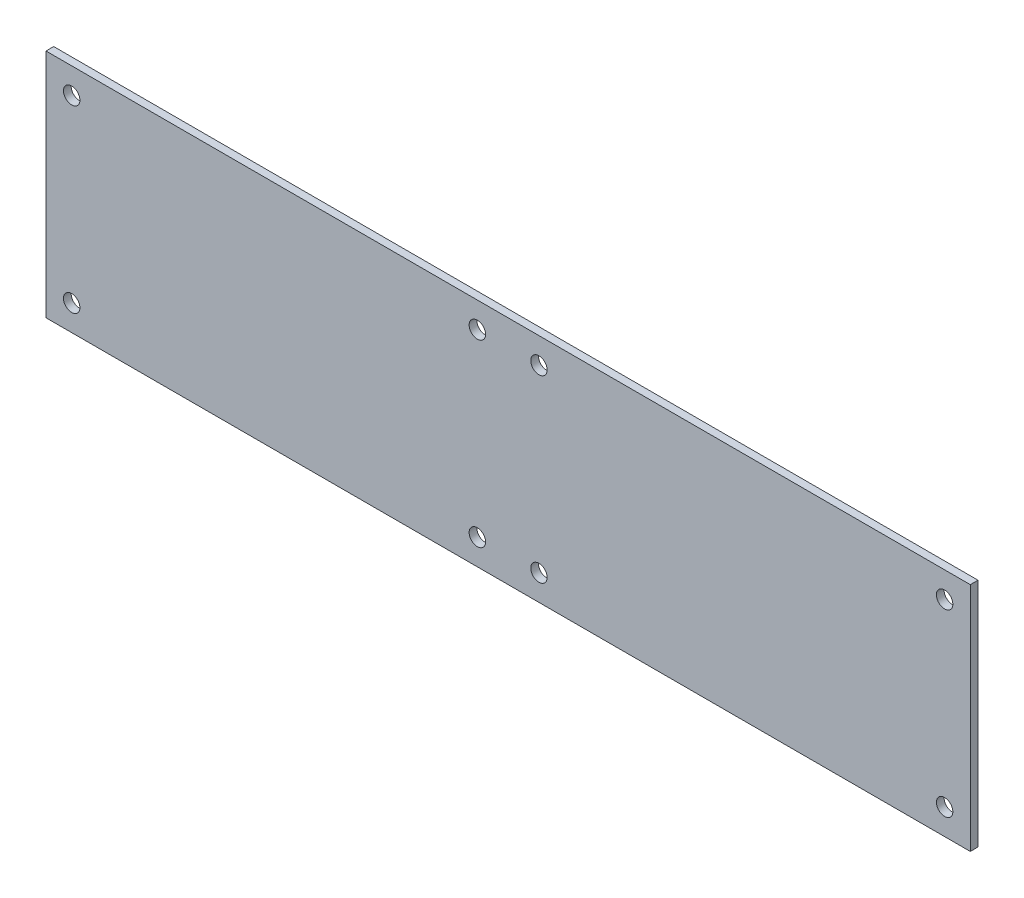
ISO-10303-21;
HEADER;
FILE_DESCRIPTION(('STEP AP214'),'2;1');
FILE_NAME('part.step','',(''),(''),'','','');
FILE_SCHEMA(('AUTOMOTIVE_DESIGN { 1 0 10303 214 1 1 1 1 }'));
ENDSEC;
DATA;
#1=APPLICATION_CONTEXT('core data for automotive mechanical design processes');
#2=APPLICATION_PROTOCOL_DEFINITION('international standard','automotive_design',2000,#1);
#3=PRODUCT_CONTEXT('',#1,'mechanical');
#4=PRODUCT('Part','Part','',(#3));
#5=PRODUCT_RELATED_PRODUCT_CATEGORY('part','',(#4));
#6=PRODUCT_DEFINITION_FORMATION('','',#4);
#7=PRODUCT_DEFINITION_CONTEXT('part definition',#1,'design');
#8=PRODUCT_DEFINITION('design','',#6,#7);
#9=PRODUCT_DEFINITION_SHAPE('','',#8);
#10=(LENGTH_UNIT() NAMED_UNIT(*) SI_UNIT(.MILLI.,.METRE.));
#11=(NAMED_UNIT(*) PLANE_ANGLE_UNIT() SI_UNIT($,.RADIAN.));
#12=(NAMED_UNIT(*) SI_UNIT($,.STERADIAN.) SOLID_ANGLE_UNIT());
#13=UNCERTAINTY_MEASURE_WITH_UNIT(LENGTH_MEASURE(1.E-05),#10,'distance_accuracy_value','');
#14=(GEOMETRIC_REPRESENTATION_CONTEXT(3) GLOBAL_UNCERTAINTY_ASSIGNED_CONTEXT((#13)) GLOBAL_UNIT_ASSIGNED_CONTEXT((#10,
#11,#12)) REPRESENTATION_CONTEXT('',''));
#15=CARTESIAN_POINT('',(0.,0.,0.));
#16=DIRECTION('',(0.,0.,1.));
#17=DIRECTION('',(1.,0.,0.));
#18=AXIS2_PLACEMENT_3D('',#15,#16,#17);
#19=CARTESIAN_POINT('',(0.,0.,1.5));
#20=DIRECTION('',(0.,0.,1.));
#21=DIRECTION('',(1.,0.,0.));
#22=AXIS2_PLACEMENT_3D('',#19,#20,#21);
#23=PLANE('',#22);
#24=CARTESIAN_POINT('',(-5.99999999999999,17.5,1.5));
#25=DIRECTION('',(0.,0.,1.));
#26=DIRECTION('',(1.,0.,0.));
#27=AXIS2_PLACEMENT_3D('',#24,#25,#26);
#28=CIRCLE('',#27,1.6);
#29=CARTESIAN_POINT('',(-4.39999999999999,17.5,1.5));
#30=VERTEX_POINT('',#29);
#31=EDGE_CURVE('E144',#30,#30,#28,.T.);
#32=ORIENTED_EDGE('',*,*,#31,.F.);
#33=EDGE_LOOP('',(#32));
#34=FACE_BOUND('',#33,.T.);
#35=CARTESIAN_POINT('',(-5.99999999999999,-17.5,1.5));
#36=DIRECTION('',(0.,0.,1.));
#37=DIRECTION('',(1.,0.,0.));
#38=AXIS2_PLACEMENT_3D('',#35,#36,#37);
#39=CIRCLE('',#38,1.6);
#40=CARTESIAN_POINT('',(-4.39999999999999,-17.5,1.5));
#41=VERTEX_POINT('',#40);
#42=EDGE_CURVE('E132',#41,#41,#39,.T.);
#43=ORIENTED_EDGE('',*,*,#42,.F.);
#44=EDGE_LOOP('',(#43));
#45=FACE_BOUND('',#44,.T.);
#46=CARTESIAN_POINT('',(85.,-17.5,1.5));
#47=DIRECTION('',(0.,0.,1.));
#48=DIRECTION('',(1.,0.,0.));
#49=AXIS2_PLACEMENT_3D('',#46,#47,#48);
#50=CIRCLE('',#49,1.6);
#51=CARTESIAN_POINT('',(86.6,-17.5,1.5));
#52=VERTEX_POINT('',#51);
#53=EDGE_CURVE('E120',#52,#52,#50,.T.);
#54=ORIENTED_EDGE('',*,*,#53,.F.);
#55=EDGE_LOOP('',(#54));
#56=FACE_BOUND('',#55,.T.);
#57=CARTESIAN_POINT('',(-85.,17.5,1.5));
#58=DIRECTION('',(0.,0.,1.));
#59=DIRECTION('',(1.,0.,0.));
#60=AXIS2_PLACEMENT_3D('',#57,#58,#59);
#61=CIRCLE('',#60,1.6);
#62=CARTESIAN_POINT('',(-83.4,17.5,1.5));
#63=VERTEX_POINT('',#62);
#64=EDGE_CURVE('E99',#63,#63,#61,.T.);
#65=ORIENTED_EDGE('',*,*,#64,.F.);
#66=EDGE_LOOP('',(#65));
#67=FACE_BOUND('',#66,.T.);
#68=DIRECTION('',(0.,-1.,0.));
#69=VECTOR('',#68,1.);
#70=CARTESIAN_POINT('',(-90.,22.5,1.5));
#71=LINE('',#70,#69);
#72=CARTESIAN_POINT('',(-90.,22.5,1.5));
#73=VERTEX_POINT('',#72);
#74=CARTESIAN_POINT('',(-90.,-22.5,1.5));
#75=VERTEX_POINT('',#74);
#76=EDGE_CURVE('E84',#73,#75,#71,.T.);
#77=ORIENTED_EDGE('',*,*,#76,.T.);
#78=DIRECTION('',(1.,0.,0.));
#79=VECTOR('',#78,1.);
#80=CARTESIAN_POINT('',(-90.,-22.5,1.5));
#81=LINE('',#80,#79);
#82=CARTESIAN_POINT('',(90.,-22.5,1.5));
#83=VERTEX_POINT('',#82);
#84=EDGE_CURVE('E79',#75,#83,#81,.T.);
#85=ORIENTED_EDGE('',*,*,#84,.T.);
#86=DIRECTION('',(0.,1.,0.));
#87=VECTOR('',#86,1.);
#88=CARTESIAN_POINT('',(90.,22.5,1.5));
#89=LINE('',#88,#87);
#90=CARTESIAN_POINT('',(90.,22.5,1.5));
#91=VERTEX_POINT('',#90);
#92=EDGE_CURVE('E82',#83,#91,#89,.T.);
#93=ORIENTED_EDGE('',*,*,#92,.T.);
#94=DIRECTION('',(-1.,0.,0.));
#95=VECTOR('',#94,1.);
#96=CARTESIAN_POINT('',(-90.,22.5,1.5));
#97=LINE('',#96,#95);
#98=EDGE_CURVE('E49',#91,#73,#97,.T.);
#99=ORIENTED_EDGE('',*,*,#98,.T.);
#100=EDGE_LOOP('',(#77,#85,#93,#99));
#101=FACE_BOUND('',#100,.T.);
#102=CARTESIAN_POINT('',(-85.,-17.5,1.5));
#103=DIRECTION('',(0.,0.,1.));
#104=DIRECTION('',(1.,0.,0.));
#105=AXIS2_PLACEMENT_3D('',#102,#103,#104);
#106=CIRCLE('',#105,1.6);
#107=CARTESIAN_POINT('',(-83.4,-17.5,1.5));
#108=VERTEX_POINT('',#107);
#109=EDGE_CURVE('E114',#108,#108,#106,.T.);
#110=ORIENTED_EDGE('',*,*,#109,.F.);
#111=EDGE_LOOP('',(#110));
#112=FACE_BOUND('',#111,.T.);
#113=CARTESIAN_POINT('',(85.,17.5,1.5));
#114=DIRECTION('',(0.,0.,1.));
#115=DIRECTION('',(1.,0.,0.));
#116=AXIS2_PLACEMENT_3D('',#113,#114,#115);
#117=CIRCLE('',#116,1.6);
#118=CARTESIAN_POINT('',(86.6,17.5,1.5));
#119=VERTEX_POINT('',#118);
#120=EDGE_CURVE('E126',#119,#119,#117,.T.);
#121=ORIENTED_EDGE('',*,*,#120,.F.);
#122=EDGE_LOOP('',(#121));
#123=FACE_BOUND('',#122,.T.);
#124=CARTESIAN_POINT('',(5.99999999999999,-17.5,1.5));
#125=DIRECTION('',(0.,0.,1.));
#126=DIRECTION('',(1.,0.,0.));
#127=AXIS2_PLACEMENT_3D('',#124,#125,#126);
#128=CIRCLE('',#127,1.6);
#129=CARTESIAN_POINT('',(7.59999999999999,-17.5,1.5));
#130=VERTEX_POINT('',#129);
#131=EDGE_CURVE('E138',#130,#130,#128,.T.);
#132=ORIENTED_EDGE('',*,*,#131,.F.);
#133=EDGE_LOOP('',(#132));
#134=FACE_BOUND('',#133,.T.);
#135=CARTESIAN_POINT('',(5.99999999999999,17.5,1.5));
#136=DIRECTION('',(0.,0.,1.));
#137=DIRECTION('',(1.,0.,0.));
#138=AXIS2_PLACEMENT_3D('',#135,#136,#137);
#139=CIRCLE('',#138,1.6);
#140=CARTESIAN_POINT('',(7.59999999999999,17.5,1.5));
#141=VERTEX_POINT('',#140);
#142=EDGE_CURVE('E150',#141,#141,#139,.T.);
#143=ORIENTED_EDGE('',*,*,#142,.F.);
#144=EDGE_LOOP('',(#143));
#145=FACE_BOUND('',#144,.T.);
#146=ADVANCED_FACE('F32',(#34,#45,#56,#67,#101,#112,#123,#134,#145),#23,.T.);
#147=CARTESIAN_POINT('',(0.,0.,0.));
#148=DIRECTION('',(0.,0.,1.));
#149=DIRECTION('',(1.,0.,0.));
#150=AXIS2_PLACEMENT_3D('',#147,#148,#149);
#151=PLANE('',#150);
#152=DIRECTION('',(0.,-1.,0.));
#153=VECTOR('',#152,1.);
#154=CARTESIAN_POINT('',(-90.,22.5,0.));
#155=LINE('',#154,#153);
#156=CARTESIAN_POINT('',(-90.,22.5,0.));
#157=VERTEX_POINT('',#156);
#158=CARTESIAN_POINT('',(-90.,-22.5,0.));
#159=VERTEX_POINT('',#158);
#160=EDGE_CURVE('E96',#157,#159,#155,.T.);
#161=ORIENTED_EDGE('',*,*,#160,.F.);
#162=DIRECTION('',(-1.,0.,0.));
#163=VECTOR('',#162,1.);
#164=CARTESIAN_POINT('',(-90.,22.5,0.));
#165=LINE('',#164,#163);
#166=CARTESIAN_POINT('',(90.,22.5,0.));
#167=VERTEX_POINT('',#166);
#168=EDGE_CURVE('E72',#167,#157,#165,.T.);
#169=ORIENTED_EDGE('',*,*,#168,.F.);
#170=DIRECTION('',(0.,1.,0.));
#171=VECTOR('',#170,1.);
#172=CARTESIAN_POINT('',(90.,22.5,0.));
#173=LINE('',#172,#171);
#174=CARTESIAN_POINT('',(90.,-22.5,0.));
#175=VERTEX_POINT('',#174);
#176=EDGE_CURVE('E66',#175,#167,#173,.T.);
#177=ORIENTED_EDGE('',*,*,#176,.F.);
#178=DIRECTION('',(1.,0.,0.));
#179=VECTOR('',#178,1.);
#180=CARTESIAN_POINT('',(-90.,-22.5,0.));
#181=LINE('',#180,#179);
#182=EDGE_CURVE('E88',#159,#175,#181,.T.);
#183=ORIENTED_EDGE('',*,*,#182,.F.);
#184=EDGE_LOOP('',(#161,#169,#177,#183));
#185=FACE_BOUND('',#184,.T.);
#186=CARTESIAN_POINT('',(-85.,17.5,0.));
#187=DIRECTION('',(0.,0.,1.));
#188=DIRECTION('',(1.,0.,0.));
#189=AXIS2_PLACEMENT_3D('',#186,#187,#188);
#190=CIRCLE('',#189,1.6);
#191=CARTESIAN_POINT('',(-83.4,17.5,0.));
#192=VERTEX_POINT('',#191);
#193=EDGE_CURVE('E111',#192,#192,#190,.T.);
#194=ORIENTED_EDGE('',*,*,#193,.T.);
#195=EDGE_LOOP('',(#194));
#196=FACE_BOUND('',#195,.T.);
#197=CARTESIAN_POINT('',(-85.,-17.5,0.));
#198=DIRECTION('',(0.,0.,1.));
#199=DIRECTION('',(1.,0.,0.));
#200=AXIS2_PLACEMENT_3D('',#197,#198,#199);
#201=CIRCLE('',#200,1.6);
#202=CARTESIAN_POINT('',(-83.4,-17.5,0.));
#203=VERTEX_POINT('',#202);
#204=EDGE_CURVE('E117',#203,#203,#201,.T.);
#205=ORIENTED_EDGE('',*,*,#204,.T.);
#206=EDGE_LOOP('',(#205));
#207=FACE_BOUND('',#206,.T.);
#208=CARTESIAN_POINT('',(85.,-17.5,0.));
#209=DIRECTION('',(0.,0.,1.));
#210=DIRECTION('',(1.,0.,0.));
#211=AXIS2_PLACEMENT_3D('',#208,#209,#210);
#212=CIRCLE('',#211,1.6);
#213=CARTESIAN_POINT('',(86.6,-17.5,0.));
#214=VERTEX_POINT('',#213);
#215=EDGE_CURVE('E123',#214,#214,#212,.T.);
#216=ORIENTED_EDGE('',*,*,#215,.T.);
#217=EDGE_LOOP('',(#216));
#218=FACE_BOUND('',#217,.T.);
#219=CARTESIAN_POINT('',(85.,17.5,0.));
#220=DIRECTION('',(0.,0.,1.));
#221=DIRECTION('',(1.,0.,0.));
#222=AXIS2_PLACEMENT_3D('',#219,#220,#221);
#223=CIRCLE('',#222,1.6);
#224=CARTESIAN_POINT('',(86.6,17.5,0.));
#225=VERTEX_POINT('',#224);
#226=EDGE_CURVE('E129',#225,#225,#223,.T.);
#227=ORIENTED_EDGE('',*,*,#226,.T.);
#228=EDGE_LOOP('',(#227));
#229=FACE_BOUND('',#228,.T.);
#230=CARTESIAN_POINT('',(-5.99999999999999,-17.5,0.));
#231=DIRECTION('',(0.,0.,1.));
#232=DIRECTION('',(1.,0.,0.));
#233=AXIS2_PLACEMENT_3D('',#230,#231,#232);
#234=CIRCLE('',#233,1.6);
#235=CARTESIAN_POINT('',(-4.39999999999999,-17.5,0.));
#236=VERTEX_POINT('',#235);
#237=EDGE_CURVE('E135',#236,#236,#234,.T.);
#238=ORIENTED_EDGE('',*,*,#237,.T.);
#239=EDGE_LOOP('',(#238));
#240=FACE_BOUND('',#239,.T.);
#241=CARTESIAN_POINT('',(5.99999999999999,-17.5,0.));
#242=DIRECTION('',(0.,0.,1.));
#243=DIRECTION('',(1.,0.,0.));
#244=AXIS2_PLACEMENT_3D('',#241,#242,#243);
#245=CIRCLE('',#244,1.6);
#246=CARTESIAN_POINT('',(7.59999999999999,-17.5,0.));
#247=VERTEX_POINT('',#246);
#248=EDGE_CURVE('E141',#247,#247,#245,.T.);
#249=ORIENTED_EDGE('',*,*,#248,.T.);
#250=EDGE_LOOP('',(#249));
#251=FACE_BOUND('',#250,.T.);
#252=CARTESIAN_POINT('',(-5.99999999999999,17.5,0.));
#253=DIRECTION('',(0.,0.,1.));
#254=DIRECTION('',(1.,0.,0.));
#255=AXIS2_PLACEMENT_3D('',#252,#253,#254);
#256=CIRCLE('',#255,1.6);
#257=CARTESIAN_POINT('',(-4.39999999999999,17.5,0.));
#258=VERTEX_POINT('',#257);
#259=EDGE_CURVE('E147',#258,#258,#256,.T.);
#260=ORIENTED_EDGE('',*,*,#259,.T.);
#261=EDGE_LOOP('',(#260));
#262=FACE_BOUND('',#261,.T.);
#263=CARTESIAN_POINT('',(5.99999999999999,17.5,0.));
#264=DIRECTION('',(0.,0.,1.));
#265=DIRECTION('',(1.,0.,0.));
#266=AXIS2_PLACEMENT_3D('',#263,#264,#265);
#267=CIRCLE('',#266,1.6);
#268=CARTESIAN_POINT('',(7.59999999999999,17.5,0.));
#269=VERTEX_POINT('',#268);
#270=EDGE_CURVE('E153',#269,#269,#267,.T.);
#271=ORIENTED_EDGE('',*,*,#270,.T.);
#272=EDGE_LOOP('',(#271));
#273=FACE_BOUND('',#272,.T.);
#274=ADVANCED_FACE('F107',(#185,#196,#207,#218,#229,#240,#251,#262,#273),#151,.F.);
#275=CARTESIAN_POINT('',(-90.,22.5,1.5));
#276=DIRECTION('',(1.,0.,0.));
#277=DIRECTION('',(0.,0.,-1.));
#278=AXIS2_PLACEMENT_3D('',#275,#276,#277);
#279=PLANE('',#278);
#280=ORIENTED_EDGE('',*,*,#160,.T.);
#281=DIRECTION('',(0.,0.,-1.));
#282=VECTOR('',#281,1.);
#283=CARTESIAN_POINT('',(-90.,-22.5,1.5));
#284=LINE('',#283,#282);
#285=EDGE_CURVE('E11',#75,#159,#284,.T.);
#286=ORIENTED_EDGE('',*,*,#285,.F.);
#287=ORIENTED_EDGE('',*,*,#76,.F.);
#288=DIRECTION('',(0.,0.,-1.));
#289=VECTOR('',#288,1.);
#290=CARTESIAN_POINT('',(-90.,22.5,1.5));
#291=LINE('',#290,#289);
#292=EDGE_CURVE('E92',#73,#157,#291,.T.);
#293=ORIENTED_EDGE('',*,*,#292,.T.);
#294=EDGE_LOOP('',(#280,#286,#287,#293));
#295=FACE_BOUND('',#294,.T.);
#296=ADVANCED_FACE('F34',(#295),#279,.F.);
#297=CARTESIAN_POINT('',(-90.,-22.5,1.5));
#298=DIRECTION('',(0.,1.,0.));
#299=DIRECTION('',(-1.,0.,0.));
#300=AXIS2_PLACEMENT_3D('',#297,#298,#299);
#301=PLANE('',#300);
#302=ORIENTED_EDGE('',*,*,#182,.T.);
#303=DIRECTION('',(0.,0.,-1.));
#304=VECTOR('',#303,1.);
#305=CARTESIAN_POINT('',(90.,-22.5,1.5));
#306=LINE('',#305,#304);
#307=EDGE_CURVE('E41',#83,#175,#306,.T.);
#308=ORIENTED_EDGE('',*,*,#307,.F.);
#309=ORIENTED_EDGE('',*,*,#84,.F.);
#310=ORIENTED_EDGE('',*,*,#285,.T.);
#311=EDGE_LOOP('',(#302,#308,#309,#310));
#312=FACE_BOUND('',#311,.T.);
#313=ADVANCED_FACE('F87',(#312),#301,.F.);
#314=CARTESIAN_POINT('',(90.,22.5,1.5));
#315=DIRECTION('',(-1.,0.,0.));
#316=DIRECTION('',(0.,0.,1.));
#317=AXIS2_PLACEMENT_3D('',#314,#315,#316);
#318=PLANE('',#317);
#319=ORIENTED_EDGE('',*,*,#176,.T.);
#320=DIRECTION('',(0.,0.,-1.));
#321=VECTOR('',#320,1.);
#322=CARTESIAN_POINT('',(90.,22.5,1.5));
#323=LINE('',#322,#321);
#324=EDGE_CURVE('E89',#91,#167,#323,.T.);
#325=ORIENTED_EDGE('',*,*,#324,.F.);
#326=ORIENTED_EDGE('',*,*,#92,.F.);
#327=ORIENTED_EDGE('',*,*,#307,.T.);
#328=EDGE_LOOP('',(#319,#325,#326,#327));
#329=FACE_BOUND('',#328,.T.);
#330=ADVANCED_FACE('F90',(#329),#318,.F.);
#331=CARTESIAN_POINT('',(-90.,22.5,1.5));
#332=DIRECTION('',(0.,-1.,0.));
#333=DIRECTION('',(0.,0.,-1.));
#334=AXIS2_PLACEMENT_3D('',#331,#332,#333);
#335=PLANE('',#334);
#336=ORIENTED_EDGE('',*,*,#168,.T.);
#337=ORIENTED_EDGE('',*,*,#292,.F.);
#338=ORIENTED_EDGE('',*,*,#98,.F.);
#339=ORIENTED_EDGE('',*,*,#324,.T.);
#340=EDGE_LOOP('',(#336,#337,#338,#339));
#341=FACE_BOUND('',#340,.T.);
#342=ADVANCED_FACE('F104',(#341),#335,.F.);
#343=CARTESIAN_POINT('',(-85.,17.5,1.5));
#344=DIRECTION('',(0.,0.,-1.));
#345=DIRECTION('',(-1.,0.,0.));
#346=AXIS2_PLACEMENT_3D('',#343,#344,#345);
#347=CYLINDRICAL_SURFACE('',#346,1.6);
#348=ORIENTED_EDGE('',*,*,#64,.T.);
#349=EDGE_LOOP('',(#348));
#350=FACE_BOUND('',#349,.T.);
#351=ORIENTED_EDGE('',*,*,#193,.F.);
#352=EDGE_LOOP('',(#351));
#353=FACE_BOUND('',#352,.T.);
#354=ADVANCED_FACE('F172',(#350,#353),#347,.F.);
#355=CARTESIAN_POINT('',(-85.,-17.5,1.5));
#356=DIRECTION('',(0.,0.,-1.));
#357=DIRECTION('',(-1.,0.,0.));
#358=AXIS2_PLACEMENT_3D('',#355,#356,#357);
#359=CYLINDRICAL_SURFACE('',#358,1.6);
#360=ORIENTED_EDGE('',*,*,#109,.T.);
#361=EDGE_LOOP('',(#360));
#362=FACE_BOUND('',#361,.T.);
#363=ORIENTED_EDGE('',*,*,#204,.F.);
#364=EDGE_LOOP('',(#363));
#365=FACE_BOUND('',#364,.T.);
#366=ADVANCED_FACE('F218',(#362,#365),#359,.F.);
#367=CARTESIAN_POINT('',(85.,-17.5,1.5));
#368=DIRECTION('',(0.,0.,-1.));
#369=DIRECTION('',(-1.,0.,0.));
#370=AXIS2_PLACEMENT_3D('',#367,#368,#369);
#371=CYLINDRICAL_SURFACE('',#370,1.6);
#372=ORIENTED_EDGE('',*,*,#53,.T.);
#373=EDGE_LOOP('',(#372));
#374=FACE_BOUND('',#373,.T.);
#375=ORIENTED_EDGE('',*,*,#215,.F.);
#376=EDGE_LOOP('',(#375));
#377=FACE_BOUND('',#376,.T.);
#378=ADVANCED_FACE('F226',(#374,#377),#371,.F.);
#379=CARTESIAN_POINT('',(85.,17.5,1.5));
#380=DIRECTION('',(0.,0.,-1.));
#381=DIRECTION('',(-1.,0.,0.));
#382=AXIS2_PLACEMENT_3D('',#379,#380,#381);
#383=CYLINDRICAL_SURFACE('',#382,1.6);
#384=ORIENTED_EDGE('',*,*,#120,.T.);
#385=EDGE_LOOP('',(#384));
#386=FACE_BOUND('',#385,.T.);
#387=ORIENTED_EDGE('',*,*,#226,.F.);
#388=EDGE_LOOP('',(#387));
#389=FACE_BOUND('',#388,.T.);
#390=ADVANCED_FACE('F234',(#386,#389),#383,.F.);
#391=CARTESIAN_POINT('',(-5.99999999999999,-17.5,1.5));
#392=DIRECTION('',(0.,0.,-1.));
#393=DIRECTION('',(-1.,0.,0.));
#394=AXIS2_PLACEMENT_3D('',#391,#392,#393);
#395=CYLINDRICAL_SURFACE('',#394,1.6);
#396=ORIENTED_EDGE('',*,*,#42,.T.);
#397=EDGE_LOOP('',(#396));
#398=FACE_BOUND('',#397,.T.);
#399=ORIENTED_EDGE('',*,*,#237,.F.);
#400=EDGE_LOOP('',(#399));
#401=FACE_BOUND('',#400,.T.);
#402=ADVANCED_FACE('F243',(#398,#401),#395,.F.);
#403=CARTESIAN_POINT('',(5.99999999999999,-17.5,1.5));
#404=DIRECTION('',(0.,0.,-1.));
#405=DIRECTION('',(-1.,0.,0.));
#406=AXIS2_PLACEMENT_3D('',#403,#404,#405);
#407=CYLINDRICAL_SURFACE('',#406,1.6);
#408=ORIENTED_EDGE('',*,*,#131,.T.);
#409=EDGE_LOOP('',(#408));
#410=FACE_BOUND('',#409,.T.);
#411=ORIENTED_EDGE('',*,*,#248,.F.);
#412=EDGE_LOOP('',(#411));
#413=FACE_BOUND('',#412,.T.);
#414=ADVANCED_FACE('F252',(#410,#413),#407,.F.);
#415=CARTESIAN_POINT('',(-5.99999999999999,17.5,1.5));
#416=DIRECTION('',(0.,0.,-1.));
#417=DIRECTION('',(-1.,0.,0.));
#418=AXIS2_PLACEMENT_3D('',#415,#416,#417);
#419=CYLINDRICAL_SURFACE('',#418,1.6);
#420=ORIENTED_EDGE('',*,*,#31,.T.);
#421=EDGE_LOOP('',(#420));
#422=FACE_BOUND('',#421,.T.);
#423=ORIENTED_EDGE('',*,*,#259,.F.);
#424=EDGE_LOOP('',(#423));
#425=FACE_BOUND('',#424,.T.);
#426=ADVANCED_FACE('F261',(#422,#425),#419,.F.);
#427=CARTESIAN_POINT('',(5.99999999999999,17.5,1.5));
#428=DIRECTION('',(0.,0.,-1.));
#429=DIRECTION('',(-1.,0.,0.));
#430=AXIS2_PLACEMENT_3D('',#427,#428,#429);
#431=CYLINDRICAL_SURFACE('',#430,1.6);
#432=ORIENTED_EDGE('',*,*,#142,.T.);
#433=EDGE_LOOP('',(#432));
#434=FACE_BOUND('',#433,.T.);
#435=ORIENTED_EDGE('',*,*,#270,.F.);
#436=EDGE_LOOP('',(#435));
#437=FACE_BOUND('',#436,.T.);
#438=ADVANCED_FACE('F159',(#434,#437),#431,.F.);
#439=CLOSED_SHELL('',(#146,#274,#296,#313,#330,#342,#354,#366,#378,#390,#402,#414,#426,#438));
#440=MANIFOLD_SOLID_BREP('B2',#439);
#441=ADVANCED_BREP_SHAPE_REPRESENTATION('',(#18,#440),#14);
#442=SHAPE_DEFINITION_REPRESENTATION(#9,#441);
ENDSEC;
END-ISO-10303-21;
